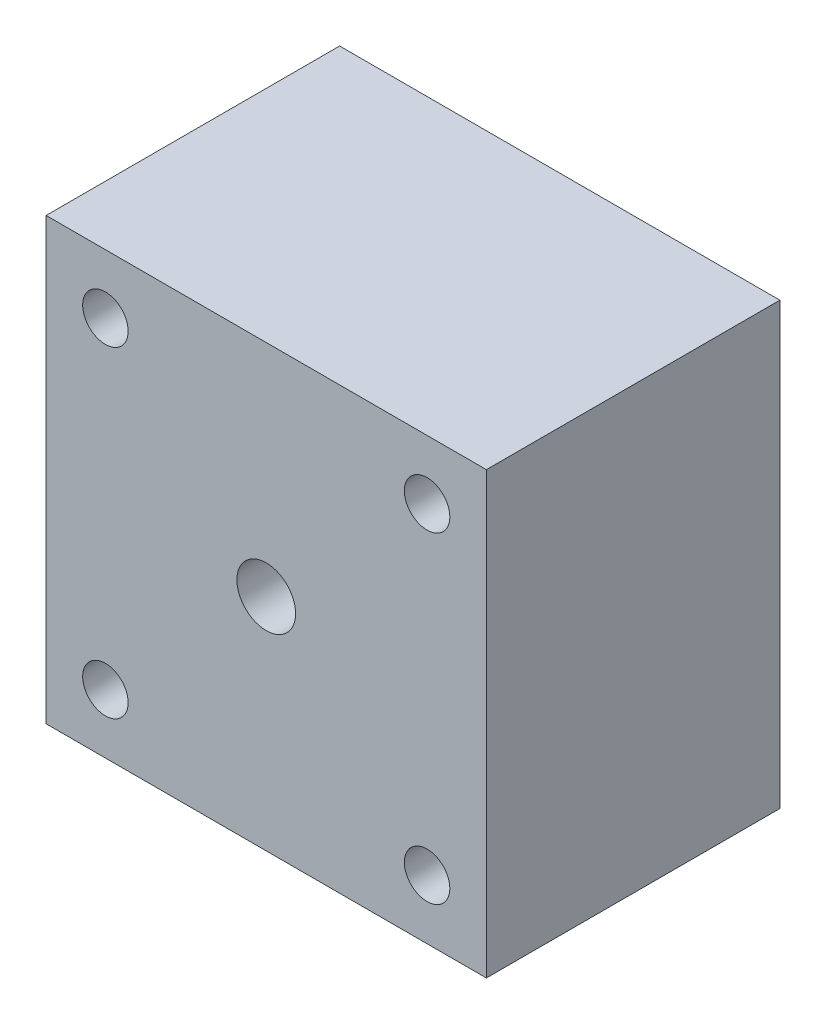
ISO-10303-21;
HEADER;
FILE_DESCRIPTION(('STEP AP214'),'2;1');
FILE_NAME('part.step','',(''),(''),'','','');
FILE_SCHEMA(('AUTOMOTIVE_DESIGN { 1 0 10303 214 1 1 1 1 }'));
ENDSEC;
DATA;
#1=APPLICATION_CONTEXT('core data for automotive mechanical design processes');
#2=APPLICATION_PROTOCOL_DEFINITION('international standard','automotive_design',2000,#1);
#3=PRODUCT_CONTEXT('',#1,'mechanical');
#4=PRODUCT('Part','Part','',(#3));
#5=PRODUCT_RELATED_PRODUCT_CATEGORY('part','',(#4));
#6=PRODUCT_DEFINITION_FORMATION('','',#4);
#7=PRODUCT_DEFINITION_CONTEXT('part definition',#1,'design');
#8=PRODUCT_DEFINITION('design','',#6,#7);
#9=PRODUCT_DEFINITION_SHAPE('','',#8);
#10=(LENGTH_UNIT() NAMED_UNIT(*) SI_UNIT(.MILLI.,.METRE.));
#11=(NAMED_UNIT(*) PLANE_ANGLE_UNIT() SI_UNIT($,.RADIAN.));
#12=(NAMED_UNIT(*) SI_UNIT($,.STERADIAN.) SOLID_ANGLE_UNIT());
#13=UNCERTAINTY_MEASURE_WITH_UNIT(LENGTH_MEASURE(1.E-05),#10,'distance_accuracy_value','');
#14=(GEOMETRIC_REPRESENTATION_CONTEXT(3) GLOBAL_UNCERTAINTY_ASSIGNED_CONTEXT((#13)) GLOBAL_UNIT_ASSIGNED_CONTEXT((#10,
#11,#12)) REPRESENTATION_CONTEXT('',''));
#15=CARTESIAN_POINT('',(0.,0.,0.));
#16=DIRECTION('',(0.,0.,1.));
#17=DIRECTION('',(1.,0.,0.));
#18=AXIS2_PLACEMENT_3D('',#15,#16,#17);
#19=CARTESIAN_POINT('',(-15.,0.,20.));
#20=DIRECTION('',(-1.,0.,0.));
#21=DIRECTION('',(0.,0.,1.));
#22=AXIS2_PLACEMENT_3D('',#19,#20,#21);
#23=PLANE('',#22);
#24=DIRECTION('',(0.,1.,0.));
#25=VECTOR('',#24,1.);
#26=CARTESIAN_POINT('',(-15.,0.,0.));
#27=LINE('',#26,#25);
#28=CARTESIAN_POINT('',(-15.,-15.,0.));
#29=VERTEX_POINT('',#28);
#30=CARTESIAN_POINT('',(-15.,15.,0.));
#31=VERTEX_POINT('',#30);
#32=EDGE_CURVE('E119',#29,#31,#27,.T.);
#33=ORIENTED_EDGE('',*,*,#32,.F.);
#34=DIRECTION('',(0.,0.,-1.));
#35=VECTOR('',#34,1.);
#36=CARTESIAN_POINT('',(-15.,-15.,20.));
#37=LINE('',#36,#35);
#38=CARTESIAN_POINT('',(-15.,-15.,20.));
#39=VERTEX_POINT('',#38);
#40=EDGE_CURVE('E11',#39,#29,#37,.T.);
#41=ORIENTED_EDGE('',*,*,#40,.F.);
#42=DIRECTION('',(0.,1.,0.));
#43=VECTOR('',#42,1.);
#44=CARTESIAN_POINT('',(-15.,0.,20.));
#45=LINE('',#44,#43);
#46=CARTESIAN_POINT('',(-15.,15.,20.));
#47=VERTEX_POINT('',#46);
#48=EDGE_CURVE('E99',#39,#47,#45,.T.);
#49=ORIENTED_EDGE('',*,*,#48,.T.);
#50=DIRECTION('',(0.,0.,-1.));
#51=VECTOR('',#50,1.);
#52=CARTESIAN_POINT('',(-15.,15.,20.));
#53=LINE('',#52,#51);
#54=EDGE_CURVE('E77',#47,#31,#53,.T.);
#55=ORIENTED_EDGE('',*,*,#54,.T.);
#56=EDGE_LOOP('',(#33,#41,#49,#55));
#57=FACE_BOUND('',#56,.T.);
#58=ADVANCED_FACE('F37',(#57),#23,.T.);
#59=CARTESIAN_POINT('',(0.,-15.,20.));
#60=DIRECTION('',(0.,-1.,0.));
#61=DIRECTION('',(0.,0.,-1.));
#62=AXIS2_PLACEMENT_3D('',#59,#60,#61);
#63=PLANE('',#62);
#64=DIRECTION('',(-1.,0.,0.));
#65=VECTOR('',#64,1.);
#66=CARTESIAN_POINT('',(0.,-15.,0.));
#67=LINE('',#66,#65);
#68=CARTESIAN_POINT('',(15.,-15.,0.));
#69=VERTEX_POINT('',#68);
#70=EDGE_CURVE('E89',#69,#29,#67,.T.);
#71=ORIENTED_EDGE('',*,*,#70,.F.);
#72=DIRECTION('',(0.,0.,-1.));
#73=VECTOR('',#72,1.);
#74=CARTESIAN_POINT('',(15.,-15.,20.));
#75=LINE('',#74,#73);
#76=CARTESIAN_POINT('',(15.,-15.,20.));
#77=VERTEX_POINT('',#76);
#78=EDGE_CURVE('E46',#77,#69,#75,.T.);
#79=ORIENTED_EDGE('',*,*,#78,.F.);
#80=DIRECTION('',(-1.,0.,0.));
#81=VECTOR('',#80,1.);
#82=CARTESIAN_POINT('',(0.,-15.,20.));
#83=LINE('',#82,#81);
#84=EDGE_CURVE('E87',#77,#39,#83,.T.);
#85=ORIENTED_EDGE('',*,*,#84,.T.);
#86=ORIENTED_EDGE('',*,*,#40,.T.);
#87=EDGE_LOOP('',(#71,#79,#85,#86));
#88=FACE_BOUND('',#87,.T.);
#89=ADVANCED_FACE('F85',(#88),#63,.T.);
#90=CARTESIAN_POINT('',(15.,0.,20.));
#91=DIRECTION('',(-1.,0.,0.));
#92=DIRECTION('',(0.,0.,1.));
#93=AXIS2_PLACEMENT_3D('',#90,#91,#92);
#94=PLANE('',#93);
#95=DIRECTION('',(0.,1.,0.));
#96=VECTOR('',#95,1.);
#97=CARTESIAN_POINT('',(15.,0.,0.));
#98=LINE('',#97,#96);
#99=CARTESIAN_POINT('',(15.,15.,0.));
#100=VERTEX_POINT('',#99);
#101=EDGE_CURVE('E122',#69,#100,#98,.T.);
#102=ORIENTED_EDGE('',*,*,#101,.T.);
#103=DIRECTION('',(0.,0.,-1.));
#104=VECTOR('',#103,1.);
#105=CARTESIAN_POINT('',(15.,15.,20.));
#106=LINE('',#105,#104);
#107=CARTESIAN_POINT('',(15.,15.,20.));
#108=VERTEX_POINT('',#107);
#109=EDGE_CURVE('E92',#108,#100,#106,.T.);
#110=ORIENTED_EDGE('',*,*,#109,.F.);
#111=DIRECTION('',(0.,1.,0.));
#112=VECTOR('',#111,1.);
#113=CARTESIAN_POINT('',(15.,0.,20.));
#114=LINE('',#113,#112);
#115=EDGE_CURVE('E94',#77,#108,#114,.T.);
#116=ORIENTED_EDGE('',*,*,#115,.F.);
#117=ORIENTED_EDGE('',*,*,#78,.T.);
#118=EDGE_LOOP('',(#102,#110,#116,#117));
#119=FACE_BOUND('',#118,.T.);
#120=ADVANCED_FACE('F95',(#119),#94,.F.);
#121=CARTESIAN_POINT('',(0.,15.,20.));
#122=DIRECTION('',(0.,-1.,0.));
#123=DIRECTION('',(0.,0.,-1.));
#124=AXIS2_PLACEMENT_3D('',#121,#122,#123);
#125=PLANE('',#124);
#126=DIRECTION('',(-1.,0.,0.));
#127=VECTOR('',#126,1.);
#128=CARTESIAN_POINT('',(0.,15.,0.));
#129=LINE('',#128,#127);
#130=EDGE_CURVE('E70',#100,#31,#129,.T.);
#131=ORIENTED_EDGE('',*,*,#130,.T.);
#132=ORIENTED_EDGE('',*,*,#54,.F.);
#133=DIRECTION('',(-1.,0.,0.));
#134=VECTOR('',#133,1.);
#135=CARTESIAN_POINT('',(0.,15.,20.));
#136=LINE('',#135,#134);
#137=EDGE_CURVE('E54',#108,#47,#136,.T.);
#138=ORIENTED_EDGE('',*,*,#137,.F.);
#139=ORIENTED_EDGE('',*,*,#109,.T.);
#140=EDGE_LOOP('',(#131,#132,#138,#139));
#141=FACE_BOUND('',#140,.T.);
#142=ADVANCED_FACE('F131',(#141),#125,.F.);
#143=CARTESIAN_POINT('',(10.9601551083915,-10.9601551083915,20.));
#144=DIRECTION('',(0.,0.,-1.));
#145=DIRECTION('',(-1.,0.,0.));
#146=AXIS2_PLACEMENT_3D('',#143,#144,#145);
#147=CYLINDRICAL_SURFACE('',#146,1.55);
#148=CARTESIAN_POINT('',(10.9601551083915,-10.9601551083915,20.));
#149=DIRECTION('',(0.,0.,1.));
#150=DIRECTION('',(1.,0.,0.));
#151=AXIS2_PLACEMENT_3D('',#148,#149,#150);
#152=CIRCLE('',#151,1.55);
#153=CARTESIAN_POINT('',(12.5101551083915,-10.9601551083915,20.));
#154=VERTEX_POINT('',#153);
#155=EDGE_CURVE('E101',#154,#154,#152,.T.);
#156=ORIENTED_EDGE('',*,*,#155,.T.);
#157=EDGE_LOOP('',(#156));
#158=FACE_BOUND('',#157,.T.);
#159=CARTESIAN_POINT('',(10.9601551083915,-10.9601551083915,0.));
#160=DIRECTION('',(0.,0.,1.));
#161=DIRECTION('',(1.,0.,0.));
#162=AXIS2_PLACEMENT_3D('',#159,#160,#161);
#163=CIRCLE('',#162,1.55);
#164=CARTESIAN_POINT('',(12.5101551083915,-10.9601551083915,0.));
#165=VERTEX_POINT('',#164);
#166=EDGE_CURVE('E116',#165,#165,#163,.T.);
#167=ORIENTED_EDGE('',*,*,#166,.F.);
#168=EDGE_LOOP('',(#167));
#169=FACE_BOUND('',#168,.T.);
#170=ADVANCED_FACE('F142',(#158,#169),#147,.F.);
#171=CARTESIAN_POINT('',(-10.9601551083915,10.9601551083915,20.));
#172=DIRECTION('',(0.,0.,-1.));
#173=DIRECTION('',(-1.,0.,0.));
#174=AXIS2_PLACEMENT_3D('',#171,#172,#173);
#175=CYLINDRICAL_SURFACE('',#174,1.55);
#176=CARTESIAN_POINT('',(-10.9601551083915,10.9601551083915,20.));
#177=DIRECTION('',(0.,0.,1.));
#178=DIRECTION('',(1.,0.,0.));
#179=AXIS2_PLACEMENT_3D('',#176,#177,#178);
#180=CIRCLE('',#179,1.55);
#181=CARTESIAN_POINT('',(-9.41015510839149,10.9601551083915,20.));
#182=VERTEX_POINT('',#181);
#183=EDGE_CURVE('E156',#182,#182,#180,.T.);
#184=ORIENTED_EDGE('',*,*,#183,.T.);
#185=EDGE_LOOP('',(#184));
#186=FACE_BOUND('',#185,.T.);
#187=CARTESIAN_POINT('',(-10.9601551083915,10.9601551083915,0.));
#188=DIRECTION('',(0.,0.,1.));
#189=DIRECTION('',(1.,0.,0.));
#190=AXIS2_PLACEMENT_3D('',#187,#188,#189);
#191=CIRCLE('',#190,1.55);
#192=CARTESIAN_POINT('',(-9.41015510839149,10.9601551083915,0.));
#193=VERTEX_POINT('',#192);
#194=EDGE_CURVE('E112',#193,#193,#191,.T.);
#195=ORIENTED_EDGE('',*,*,#194,.F.);
#196=EDGE_LOOP('',(#195));
#197=FACE_BOUND('',#196,.T.);
#198=ADVANCED_FACE('F144',(#186,#197),#175,.F.);
#199=CARTESIAN_POINT('',(-10.9601551083915,-10.9601551083915,20.));
#200=DIRECTION('',(0.,0.,-1.));
#201=DIRECTION('',(-1.,0.,0.));
#202=AXIS2_PLACEMENT_3D('',#199,#200,#201);
#203=CYLINDRICAL_SURFACE('',#202,1.55);
#204=CARTESIAN_POINT('',(-10.9601551083915,-10.9601551083915,20.));
#205=DIRECTION('',(0.,0.,1.));
#206=DIRECTION('',(1.,0.,0.));
#207=AXIS2_PLACEMENT_3D('',#204,#205,#206);
#208=CIRCLE('',#207,1.55);
#209=CARTESIAN_POINT('',(-9.41015510839149,-10.9601551083915,20.));
#210=VERTEX_POINT('',#209);
#211=EDGE_CURVE('E128',#210,#210,#208,.F.);
#212=ORIENTED_EDGE('',*,*,#211,.F.);
#213=EDGE_LOOP('',(#212));
#214=FACE_BOUND('',#213,.T.);
#215=CARTESIAN_POINT('',(-10.9601551083915,-10.9601551083915,0.));
#216=DIRECTION('',(0.,0.,1.));
#217=DIRECTION('',(1.,0.,0.));
#218=AXIS2_PLACEMENT_3D('',#215,#216,#217);
#219=CIRCLE('',#218,1.55);
#220=CARTESIAN_POINT('',(-9.41015510839149,-10.9601551083915,0.));
#221=VERTEX_POINT('',#220);
#222=EDGE_CURVE('E109',#221,#221,#219,.F.);
#223=ORIENTED_EDGE('',*,*,#222,.T.);
#224=EDGE_LOOP('',(#223));
#225=FACE_BOUND('',#224,.T.);
#226=ADVANCED_FACE('F39',(#214,#225),#203,.F.);
#227=CARTESIAN_POINT('',(10.9601551083915,10.9601551083915,20.));
#228=DIRECTION('',(0.,0.,-1.));
#229=DIRECTION('',(-1.,0.,0.));
#230=AXIS2_PLACEMENT_3D('',#227,#228,#229);
#231=CYLINDRICAL_SURFACE('',#230,1.55);
#232=CARTESIAN_POINT('',(10.9601551083915,10.9601551083915,20.));
#233=DIRECTION('',(0.,0.,1.));
#234=DIRECTION('',(1.,0.,0.));
#235=AXIS2_PLACEMENT_3D('',#232,#233,#234);
#236=CIRCLE('',#235,1.55);
#237=CARTESIAN_POINT('',(12.5101551083915,10.9601551083915,20.));
#238=VERTEX_POINT('',#237);
#239=EDGE_CURVE('E106',#238,#238,#236,.F.);
#240=ORIENTED_EDGE('',*,*,#239,.F.);
#241=EDGE_LOOP('',(#240));
#242=FACE_BOUND('',#241,.T.);
#243=CARTESIAN_POINT('',(10.9601551083915,10.9601551083915,0.));
#244=DIRECTION('',(0.,0.,1.));
#245=DIRECTION('',(1.,0.,0.));
#246=AXIS2_PLACEMENT_3D('',#243,#244,#245);
#247=CIRCLE('',#246,1.55);
#248=CARTESIAN_POINT('',(12.5101551083915,10.9601551083915,0.));
#249=VERTEX_POINT('',#248);
#250=EDGE_CURVE('E125',#249,#249,#247,.F.);
#251=ORIENTED_EDGE('',*,*,#250,.T.);
#252=EDGE_LOOP('',(#251));
#253=FACE_BOUND('',#252,.T.);
#254=ADVANCED_FACE('F151',(#242,#253),#231,.F.);
#255=CARTESIAN_POINT('',(0.,0.,20.));
#256=DIRECTION('',(0.,0.,1.));
#257=DIRECTION('',(1.,0.,0.));
#258=AXIS2_PLACEMENT_3D('',#255,#256,#257);
#259=PLANE('',#258);
#260=CARTESIAN_POINT('',(0.,0.,20.));
#261=DIRECTION('',(0.,0.,1.));
#262=DIRECTION('',(1.,0.,0.));
#263=AXIS2_PLACEMENT_3D('',#260,#261,#262);
#264=CIRCLE('',#263,2.);
#265=CARTESIAN_POINT('',(2.,0.,20.));
#266=VERTEX_POINT('',#265);
#267=EDGE_CURVE('E245',#266,#266,#264,.T.);
#268=ORIENTED_EDGE('',*,*,#267,.F.);
#269=EDGE_LOOP('',(#268));
#270=FACE_BOUND('',#269,.T.);
#271=ORIENTED_EDGE('',*,*,#211,.T.);
#272=EDGE_LOOP('',(#271));
#273=FACE_BOUND('',#272,.T.);
#274=ORIENTED_EDGE('',*,*,#183,.F.);
#275=EDGE_LOOP('',(#274));
#276=FACE_BOUND('',#275,.T.);
#277=ORIENTED_EDGE('',*,*,#155,.F.);
#278=EDGE_LOOP('',(#277));
#279=FACE_BOUND('',#278,.T.);
#280=ORIENTED_EDGE('',*,*,#48,.F.);
#281=ORIENTED_EDGE('',*,*,#84,.F.);
#282=ORIENTED_EDGE('',*,*,#115,.T.);
#283=ORIENTED_EDGE('',*,*,#137,.T.);
#284=EDGE_LOOP('',(#280,#281,#282,#283));
#285=FACE_BOUND('',#284,.T.);
#286=ORIENTED_EDGE('',*,*,#239,.T.);
#287=EDGE_LOOP('',(#286));
#288=FACE_BOUND('',#287,.T.);
#289=ADVANCED_FACE('F97',(#270,#273,#276,#279,#285,#288),#259,.T.);
#290=CARTESIAN_POINT('',(0.,0.,0.));
#291=DIRECTION('',(0.,0.,1.));
#292=DIRECTION('',(1.,0.,0.));
#293=AXIS2_PLACEMENT_3D('',#290,#291,#292);
#294=PLANE('',#293);
#295=ORIENTED_EDGE('',*,*,#222,.F.);
#296=EDGE_LOOP('',(#295));
#297=FACE_BOUND('',#296,.T.);
#298=ORIENTED_EDGE('',*,*,#194,.T.);
#299=EDGE_LOOP('',(#298));
#300=FACE_BOUND('',#299,.T.);
#301=ORIENTED_EDGE('',*,*,#166,.T.);
#302=EDGE_LOOP('',(#301));
#303=FACE_BOUND('',#302,.T.);
#304=ORIENTED_EDGE('',*,*,#32,.T.);
#305=ORIENTED_EDGE('',*,*,#130,.F.);
#306=ORIENTED_EDGE('',*,*,#101,.F.);
#307=ORIENTED_EDGE('',*,*,#70,.T.);
#308=EDGE_LOOP('',(#304,#305,#306,#307));
#309=FACE_BOUND('',#308,.T.);
#310=ORIENTED_EDGE('',*,*,#250,.F.);
#311=EDGE_LOOP('',(#310));
#312=FACE_BOUND('',#311,.T.);
#313=ADVANCED_FACE('F132',(#297,#300,#303,#309,#312),#294,.F.);
#314=CARTESIAN_POINT('',(0.,0.,10.));
#315=DIRECTION('',(0.,0.,1.));
#316=DIRECTION('',(1.,0.,0.));
#317=AXIS2_PLACEMENT_3D('',#314,#315,#316);
#318=CYLINDRICAL_SURFACE('',#317,2.);
#319=CARTESIAN_POINT('',(0.,0.,10.));
#320=DIRECTION('',(0.,0.,1.));
#321=DIRECTION('',(1.,0.,0.));
#322=AXIS2_PLACEMENT_3D('',#319,#320,#321);
#323=CIRCLE('',#322,2.);
#324=CARTESIAN_POINT('',(2.,0.,10.));
#325=VERTEX_POINT('',#324);
#326=EDGE_CURVE('E113',#325,#325,#323,.T.);
#327=ORIENTED_EDGE('',*,*,#326,.F.);
#328=EDGE_LOOP('',(#327));
#329=FACE_BOUND('',#328,.T.);
#330=ORIENTED_EDGE('',*,*,#267,.T.);
#331=EDGE_LOOP('',(#330));
#332=FACE_BOUND('',#331,.T.);
#333=ADVANCED_FACE('F161',(#329,#332),#318,.F.);
#334=CARTESIAN_POINT('',(0.,0.,10.));
#335=DIRECTION('',(0.,0.,1.));
#336=DIRECTION('',(1.,0.,0.));
#337=AXIS2_PLACEMENT_3D('',#334,#335,#336);
#338=PLANE('',#337);
#339=ORIENTED_EDGE('',*,*,#326,.T.);
#340=EDGE_LOOP('',(#339));
#341=FACE_BOUND('',#340,.T.);
#342=ADVANCED_FACE('F170',(#341),#338,.T.);
#343=CLOSED_SHELL('',(#58,#89,#120,#142,#170,#198,#226,#254,#289,#313,#333,#342));
#344=MANIFOLD_SOLID_BREP('B2',#343);
#345=ADVANCED_BREP_SHAPE_REPRESENTATION('',(#18,#344),#14);
#346=SHAPE_DEFINITION_REPRESENTATION(#9,#345);
ENDSEC;
END-ISO-10303-21;
